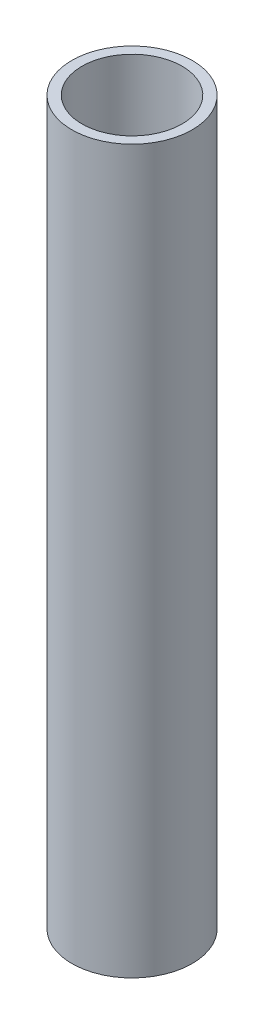
ISO-10303-21;
HEADER;
FILE_DESCRIPTION(('STEP AP214'),'2;1');
FILE_NAME('part.step','',(''),(''),'','','');
FILE_SCHEMA(('AUTOMOTIVE_DESIGN { 1 0 10303 214 1 1 1 1 }'));
ENDSEC;
DATA;
#1=APPLICATION_CONTEXT('core data for automotive mechanical design processes');
#2=APPLICATION_PROTOCOL_DEFINITION('international standard','automotive_design',2000,#1);
#3=PRODUCT_CONTEXT('',#1,'mechanical');
#4=PRODUCT('Part','Part','',(#3));
#5=PRODUCT_RELATED_PRODUCT_CATEGORY('part','',(#4));
#6=PRODUCT_DEFINITION_FORMATION('','',#4);
#7=PRODUCT_DEFINITION_CONTEXT('part definition',#1,'design');
#8=PRODUCT_DEFINITION('design','',#6,#7);
#9=PRODUCT_DEFINITION_SHAPE('','',#8);
#10=(LENGTH_UNIT() NAMED_UNIT(*) SI_UNIT(.MILLI.,.METRE.));
#11=(NAMED_UNIT(*) PLANE_ANGLE_UNIT() SI_UNIT($,.RADIAN.));
#12=(NAMED_UNIT(*) SI_UNIT($,.STERADIAN.) SOLID_ANGLE_UNIT());
#13=UNCERTAINTY_MEASURE_WITH_UNIT(LENGTH_MEASURE(1.E-05),#10,'distance_accuracy_value','');
#14=(GEOMETRIC_REPRESENTATION_CONTEXT(3) GLOBAL_UNCERTAINTY_ASSIGNED_CONTEXT((#13)) GLOBAL_UNIT_ASSIGNED_CONTEXT((#10,
#11,#12)) REPRESENTATION_CONTEXT('',''));
#15=CARTESIAN_POINT('',(0.,0.,0.));
#16=DIRECTION('',(0.,0.,1.));
#17=DIRECTION('',(1.,0.,0.));
#18=AXIS2_PLACEMENT_3D('',#15,#16,#17);
#19=CARTESIAN_POINT('',(0.,-274.350329179617,277.294378666385));
#20=DIRECTION('',(0.,1.,0.));
#21=DIRECTION('',(0.,0.,1.));
#22=AXIS2_PLACEMENT_3D('',#19,#20,#21);
#23=CYLINDRICAL_SURFACE('',#22,5.28319999999999);
#24=CARTESIAN_POINT('',(0.,-274.350329179617,277.294378666385));
#25=DIRECTION('',(0.,-1.,0.));
#26=DIRECTION('',(0.,0.,-1.));
#27=AXIS2_PLACEMENT_3D('',#24,#25,#26);
#28=CIRCLE('',#27,5.28319999999999);
#29=CARTESIAN_POINT('',(0.,-274.350329179617,272.011178666385));
#30=VERTEX_POINT('',#29);
#31=EDGE_CURVE('E42',#30,#30,#28,.T.);
#32=ORIENTED_EDGE('',*,*,#31,.T.);
#33=EDGE_LOOP('',(#32));
#34=FACE_BOUND('',#33,.T.);
#35=CARTESIAN_POINT('',(0.,-198.150329179617,277.294378666385));
#36=DIRECTION('',(0.,-1.,0.));
#37=DIRECTION('',(0.,0.,-1.));
#38=AXIS2_PLACEMENT_3D('',#35,#36,#37);
#39=CIRCLE('',#38,5.28319999999999);
#40=CARTESIAN_POINT('',(0.,-198.150329179617,272.011178666385));
#41=VERTEX_POINT('',#40);
#42=EDGE_CURVE('E48',#41,#41,#39,.T.);
#43=ORIENTED_EDGE('',*,*,#42,.F.);
#44=EDGE_LOOP('',(#43));
#45=FACE_BOUND('',#44,.T.);
#46=ADVANCED_FACE('F35',(#34,#45),#23,.F.);
#47=CARTESIAN_POINT('',(0.,-274.350329179617,277.294378666385));
#48=DIRECTION('',(0.,1.,0.));
#49=DIRECTION('',(0.,0.,1.));
#50=AXIS2_PLACEMENT_3D('',#47,#48,#49);
#51=CYLINDRICAL_SURFACE('',#50,6.35);
#52=CARTESIAN_POINT('',(0.,-274.350329179617,277.294378666385));
#53=DIRECTION('',(0.,-1.,0.));
#54=DIRECTION('',(0.,0.,-1.));
#55=AXIS2_PLACEMENT_3D('',#52,#53,#54);
#56=CIRCLE('',#55,6.35);
#57=CARTESIAN_POINT('',(0.,-274.350329179617,270.944378666385));
#58=VERTEX_POINT('',#57);
#59=EDGE_CURVE('E11',#58,#58,#56,.T.);
#60=ORIENTED_EDGE('',*,*,#59,.F.);
#61=EDGE_LOOP('',(#60));
#62=FACE_BOUND('',#61,.T.);
#63=CARTESIAN_POINT('',(0.,-198.150329179617,277.294378666385));
#64=DIRECTION('',(0.,-1.,0.));
#65=DIRECTION('',(0.,0.,-1.));
#66=AXIS2_PLACEMENT_3D('',#63,#64,#65);
#67=CIRCLE('',#66,6.35);
#68=CARTESIAN_POINT('',(0.,-198.150329179617,270.944378666385));
#69=VERTEX_POINT('',#68);
#70=EDGE_CURVE('E38',#69,#69,#67,.T.);
#71=ORIENTED_EDGE('',*,*,#70,.T.);
#72=EDGE_LOOP('',(#71));
#73=FACE_BOUND('',#72,.T.);
#74=ADVANCED_FACE('F55',(#62,#73),#51,.T.);
#75=CARTESIAN_POINT('',(0.,-274.350329179617,277.294378666385));
#76=DIRECTION('',(0.,-1.,0.));
#77=DIRECTION('',(0.,0.,-1.));
#78=AXIS2_PLACEMENT_3D('',#75,#76,#77);
#79=PLANE('',#78);
#80=ORIENTED_EDGE('',*,*,#31,.F.);
#81=EDGE_LOOP('',(#80));
#82=FACE_BOUND('',#81,.T.);
#83=ORIENTED_EDGE('',*,*,#59,.T.);
#84=EDGE_LOOP('',(#83));
#85=FACE_BOUND('',#84,.T.);
#86=ADVANCED_FACE('F59',(#82,#85),#79,.T.);
#87=CARTESIAN_POINT('',(0.,-198.150329179617,277.294378666385));
#88=DIRECTION('',(0.,-1.,0.));
#89=DIRECTION('',(0.,0.,-1.));
#90=AXIS2_PLACEMENT_3D('',#87,#88,#89);
#91=PLANE('',#90);
#92=ORIENTED_EDGE('',*,*,#42,.T.);
#93=EDGE_LOOP('',(#92));
#94=FACE_BOUND('',#93,.T.);
#95=ORIENTED_EDGE('',*,*,#70,.F.);
#96=EDGE_LOOP('',(#95));
#97=FACE_BOUND('',#96,.T.);
#98=ADVANCED_FACE('F57',(#94,#97),#91,.F.);
#99=CLOSED_SHELL('',(#46,#74,#86,#98));
#100=MANIFOLD_SOLID_BREP('B2',#99);
#101=ADVANCED_BREP_SHAPE_REPRESENTATION('',(#18,#100),#14);
#102=SHAPE_DEFINITION_REPRESENTATION(#9,#101);
ENDSEC;
END-ISO-10303-21;
